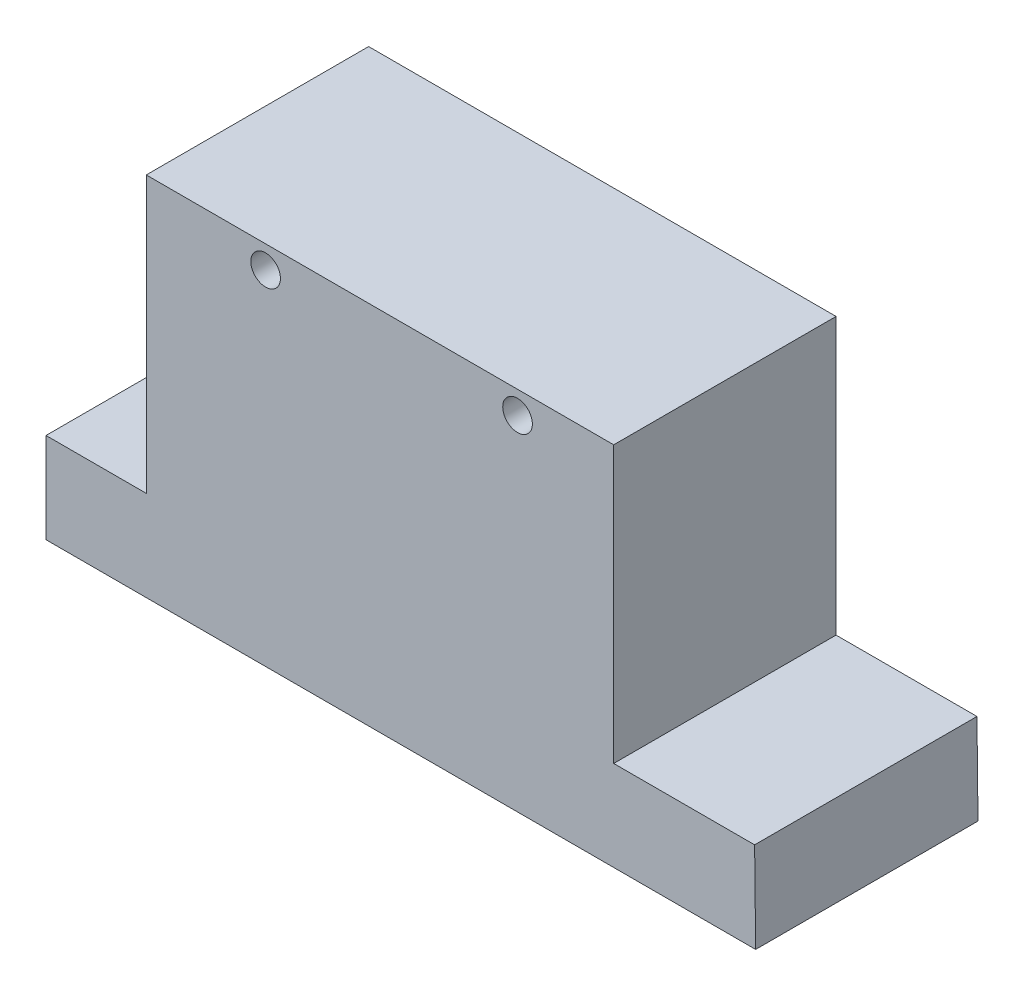
ISO-10303-21;
HEADER;
FILE_DESCRIPTION(('STEP AP214'),'2;1');
FILE_NAME('part.step','',(''),(''),'','','');
FILE_SCHEMA(('AUTOMOTIVE_DESIGN { 1 0 10303 214 1 1 1 1 }'));
ENDSEC;
DATA;
#1=APPLICATION_CONTEXT('core data for automotive mechanical design processes');
#2=APPLICATION_PROTOCOL_DEFINITION('international standard','automotive_design',2000,#1);
#3=PRODUCT_CONTEXT('',#1,'mechanical');
#4=PRODUCT('Part','Part','',(#3));
#5=PRODUCT_RELATED_PRODUCT_CATEGORY('part','',(#4));
#6=PRODUCT_DEFINITION_FORMATION('','',#4);
#7=PRODUCT_DEFINITION_CONTEXT('part definition',#1,'design');
#8=PRODUCT_DEFINITION('design','',#6,#7);
#9=PRODUCT_DEFINITION_SHAPE('','',#8);
#10=(LENGTH_UNIT() NAMED_UNIT(*) SI_UNIT(.MILLI.,.METRE.));
#11=(NAMED_UNIT(*) PLANE_ANGLE_UNIT() SI_UNIT($,.RADIAN.));
#12=(NAMED_UNIT(*) SI_UNIT($,.STERADIAN.) SOLID_ANGLE_UNIT());
#13=UNCERTAINTY_MEASURE_WITH_UNIT(LENGTH_MEASURE(1.E-05),#10,'distance_accuracy_value','');
#14=(GEOMETRIC_REPRESENTATION_CONTEXT(3) GLOBAL_UNCERTAINTY_ASSIGNED_CONTEXT((#13)) GLOBAL_UNIT_ASSIGNED_CONTEXT((#10,
#11,#12)) REPRESENTATION_CONTEXT('',''));
#15=CARTESIAN_POINT('',(0.,0.,0.));
#16=DIRECTION('',(0.,0.,1.));
#17=DIRECTION('',(1.,0.,0.));
#18=AXIS2_PLACEMENT_3D('',#15,#16,#17);
#19=CARTESIAN_POINT('',(0.,0.,60.));
#20=DIRECTION('',(0.,0.,1.));
#21=DIRECTION('',(1.,0.,0.));
#22=AXIS2_PLACEMENT_3D('',#19,#20,#21);
#23=PLANE('',#22);
#24=CARTESIAN_POINT('',(-46.2713659081402,61.5865207292527,60.));
#25=DIRECTION('',(0.,0.,1.));
#26=DIRECTION('',(1.,0.,0.));
#27=AXIS2_PLACEMENT_3D('',#24,#25,#26);
#28=CIRCLE('',#27,4.00000000000001);
#29=CARTESIAN_POINT('',(-42.2713659081402,61.5865207292527,60.));
#30=VERTEX_POINT('',#29);
#31=EDGE_CURVE('E135',#30,#30,#28,.T.);
#32=ORIENTED_EDGE('',*,*,#31,.F.);
#33=EDGE_LOOP('',(#32));
#34=FACE_BOUND('',#33,.T.);
#35=DIRECTION('',(1.,0.,0.));
#36=VECTOR('',#35,1.);
#37=CARTESIAN_POINT('',(-55.837306641314,-31.0846861714532,60.));
#38=LINE('',#37,#36);
#39=CARTESIAN_POINT('',(-105.534428359872,-31.0846861714532,60.));
#40=VERTEX_POINT('',#39);
#41=CARTESIAN_POINT('',(85.9646266435408,-31.0846861714532,60.));
#42=VERTEX_POINT('',#41);
#43=EDGE_CURVE('E52',#40,#42,#38,.T.);
#44=ORIENTED_EDGE('',*,*,#43,.T.);
#45=DIRECTION('',(-0.0114992295133664,0.999933881674483,0.));
#46=VECTOR('',#45,1.);
#47=CARTESIAN_POINT('',(85.6850373949808,-6.77255619247591,60.));
#48=LINE('',#47,#46);
#49=CARTESIAN_POINT('',(85.6850373949808,-6.77255619247591,60.));
#50=VERTEX_POINT('',#49);
#51=EDGE_CURVE('E181',#42,#50,#48,.T.);
#52=ORIENTED_EDGE('',*,*,#51,.T.);
#53=DIRECTION('',(-1.,0.,0.));
#54=VECTOR('',#53,1.);
#55=CARTESIAN_POINT('',(47.6605646258548,-6.77255619247591,60.));
#56=LINE('',#55,#54);
#57=CARTESIAN_POINT('',(47.6605646258548,-6.77255619247591,60.));
#58=VERTEX_POINT('',#57);
#59=EDGE_CURVE('E161',#50,#58,#56,.T.);
#60=ORIENTED_EDGE('',*,*,#59,.T.);
#61=DIRECTION('',(0.,1.,0.));
#62=VECTOR('',#61,1.);
#63=CARTESIAN_POINT('',(47.6605646258548,-6.77255619247591,60.));
#64=LINE('',#63,#62);
#65=CARTESIAN_POINT('',(47.6605646258545,67.7011176079763,60.));
#66=VERTEX_POINT('',#65);
#67=EDGE_CURVE('E177',#58,#66,#64,.T.);
#68=ORIENTED_EDGE('',*,*,#67,.T.);
#69=DIRECTION('',(-1.,0.,0.));
#70=VECTOR('',#69,1.);
#71=CARTESIAN_POINT('',(-78.4773436223531,67.7011176079763,60.));
#72=LINE('',#71,#70);
#73=CARTESIAN_POINT('',(-78.4773436223531,67.7011176079763,60.));
#74=VERTEX_POINT('',#73);
#75=EDGE_CURVE('E112',#66,#74,#72,.T.);
#76=ORIENTED_EDGE('',*,*,#75,.T.);
#77=DIRECTION('',(0.,-1.,0.));
#78=VECTOR('',#77,1.);
#79=CARTESIAN_POINT('',(-78.4773436223531,-6.71582725926458,60.));
#80=LINE('',#79,#78);
#81=CARTESIAN_POINT('',(-78.4773436223531,-6.71582725926458,60.));
#82=VERTEX_POINT('',#81);
#83=EDGE_CURVE('E106',#74,#82,#80,.T.);
#84=ORIENTED_EDGE('',*,*,#83,.T.);
#85=DIRECTION('',(-1.,0.,0.));
#86=VECTOR('',#85,1.);
#87=CARTESIAN_POINT('',(-78.4773436223531,-6.71582725926458,60.));
#88=LINE('',#87,#86);
#89=CARTESIAN_POINT('',(-105.534428359872,-6.71582725926458,60.));
#90=VERTEX_POINT('',#89);
#91=EDGE_CURVE('E110',#82,#90,#88,.T.);
#92=ORIENTED_EDGE('',*,*,#91,.T.);
#93=DIRECTION('',(0.,-1.,0.));
#94=VECTOR('',#93,1.);
#95=CARTESIAN_POINT('',(-105.534428359872,-6.71582725926458,60.));
#96=LINE('',#95,#94);
#97=EDGE_CURVE('E126',#90,#40,#96,.T.);
#98=ORIENTED_EDGE('',*,*,#97,.T.);
#99=EDGE_LOOP('',(#44,#52,#60,#68,#76,#84,#92,#98));
#100=FACE_BOUND('',#99,.T.);
#101=CARTESIAN_POINT('',(21.7106262171154,61.5865207292527,60.));
#102=DIRECTION('',(0.,0.,1.));
#103=DIRECTION('',(-1.,0.,0.));
#104=AXIS2_PLACEMENT_3D('',#101,#102,#103);
#105=CIRCLE('',#104,4.00000000000001);
#106=CARTESIAN_POINT('',(17.7106262171154,61.5865207292527,60.));
#107=VERTEX_POINT('',#106);
#108=EDGE_CURVE('E187',#107,#107,#105,.T.);
#109=ORIENTED_EDGE('',*,*,#108,.F.);
#110=EDGE_LOOP('',(#109));
#111=FACE_BOUND('',#110,.T.);
#112=ADVANCED_FACE('F35',(#34,#100,#111),#23,.T.);
#113=CARTESIAN_POINT('',(0.,0.,0.));
#114=DIRECTION('',(0.,0.,1.));
#115=DIRECTION('',(1.,0.,0.));
#116=AXIS2_PLACEMENT_3D('',#113,#114,#115);
#117=PLANE('',#116);
#118=DIRECTION('',(-0.0114992295133664,0.999933881674483,0.));
#119=VECTOR('',#118,1.);
#120=CARTESIAN_POINT('',(85.6850373949808,-6.77255619247591,0.));
#121=LINE('',#120,#119);
#122=CARTESIAN_POINT('',(85.9646266435408,-31.0846861714532,0.));
#123=VERTEX_POINT('',#122);
#124=CARTESIAN_POINT('',(85.6850373949808,-6.77255619247591,0.));
#125=VERTEX_POINT('',#124);
#126=EDGE_CURVE('E132',#123,#125,#121,.T.);
#127=ORIENTED_EDGE('',*,*,#126,.F.);
#128=DIRECTION('',(1.,0.,0.));
#129=VECTOR('',#128,1.);
#130=CARTESIAN_POINT('',(-55.837306641314,-31.0846861714532,0.));
#131=LINE('',#130,#129);
#132=CARTESIAN_POINT('',(-105.534428359872,-31.0846861714532,0.));
#133=VERTEX_POINT('',#132);
#134=EDGE_CURVE('E144',#133,#123,#131,.T.);
#135=ORIENTED_EDGE('',*,*,#134,.F.);
#136=DIRECTION('',(0.,-1.,0.));
#137=VECTOR('',#136,1.);
#138=CARTESIAN_POINT('',(-105.534428359872,-6.71582725926458,0.));
#139=LINE('',#138,#137);
#140=CARTESIAN_POINT('',(-105.534428359872,-6.71582725926458,0.));
#141=VERTEX_POINT('',#140);
#142=EDGE_CURVE('E89',#141,#133,#139,.T.);
#143=ORIENTED_EDGE('',*,*,#142,.F.);
#144=DIRECTION('',(-1.,0.,0.));
#145=VECTOR('',#144,1.);
#146=CARTESIAN_POINT('',(-78.4773436223531,-6.71582725926458,0.));
#147=LINE('',#146,#145);
#148=CARTESIAN_POINT('',(-78.4773436223531,-6.71582725926458,0.));
#149=VERTEX_POINT('',#148);
#150=EDGE_CURVE('E82',#149,#141,#147,.T.);
#151=ORIENTED_EDGE('',*,*,#150,.F.);
#152=DIRECTION('',(0.,-1.,0.));
#153=VECTOR('',#152,1.);
#154=CARTESIAN_POINT('',(-78.4773436223531,-6.71582725926458,0.));
#155=LINE('',#154,#153);
#156=CARTESIAN_POINT('',(-78.4773436223531,67.7011176079763,0.));
#157=VERTEX_POINT('',#156);
#158=EDGE_CURVE('E120',#157,#149,#155,.T.);
#159=ORIENTED_EDGE('',*,*,#158,.F.);
#160=DIRECTION('',(-1.,0.,0.));
#161=VECTOR('',#160,1.);
#162=CARTESIAN_POINT('',(-78.4773436223531,67.7011176079763,0.));
#163=LINE('',#162,#161);
#164=CARTESIAN_POINT('',(47.6605646258545,67.7011176079763,0.));
#165=VERTEX_POINT('',#164);
#166=EDGE_CURVE('E139',#165,#157,#163,.T.);
#167=ORIENTED_EDGE('',*,*,#166,.F.);
#168=DIRECTION('',(0.,1.,0.));
#169=VECTOR('',#168,1.);
#170=CARTESIAN_POINT('',(47.6605646258548,-6.77255619247591,0.));
#171=LINE('',#170,#169);
#172=CARTESIAN_POINT('',(47.6605646258548,-6.77255619247591,0.));
#173=VERTEX_POINT('',#172);
#174=EDGE_CURVE('E137',#173,#165,#171,.T.);
#175=ORIENTED_EDGE('',*,*,#174,.F.);
#176=DIRECTION('',(-1.,0.,0.));
#177=VECTOR('',#176,1.);
#178=CARTESIAN_POINT('',(47.6605646258548,-6.77255619247591,0.));
#179=LINE('',#178,#177);
#180=EDGE_CURVE('E134',#125,#173,#179,.T.);
#181=ORIENTED_EDGE('',*,*,#180,.F.);
#182=EDGE_LOOP('',(#127,#135,#143,#151,#159,#167,#175,#181));
#183=FACE_BOUND('',#182,.T.);
#184=CARTESIAN_POINT('',(-46.2713659081402,61.5865207292527,0.));
#185=DIRECTION('',(0.,0.,1.));
#186=DIRECTION('',(1.,0.,0.));
#187=AXIS2_PLACEMENT_3D('',#184,#185,#186);
#188=CIRCLE('',#187,4.00000000000001);
#189=CARTESIAN_POINT('',(-42.2713659081402,61.5865207292527,0.));
#190=VERTEX_POINT('',#189);
#191=EDGE_CURVE('E184',#190,#190,#188,.T.);
#192=ORIENTED_EDGE('',*,*,#191,.T.);
#193=EDGE_LOOP('',(#192));
#194=FACE_BOUND('',#193,.T.);
#195=CARTESIAN_POINT('',(21.7106262171154,61.5865207292527,0.));
#196=DIRECTION('',(0.,0.,1.));
#197=DIRECTION('',(-1.,0.,0.));
#198=AXIS2_PLACEMENT_3D('',#195,#196,#197);
#199=CIRCLE('',#198,4.00000000000001);
#200=CARTESIAN_POINT('',(17.7106262171154,61.5865207292527,0.));
#201=VERTEX_POINT('',#200);
#202=EDGE_CURVE('E190',#201,#201,#199,.T.);
#203=ORIENTED_EDGE('',*,*,#202,.T.);
#204=EDGE_LOOP('',(#203));
#205=FACE_BOUND('',#204,.T.);
#206=ADVANCED_FACE('F167',(#183,#194,#205),#117,.F.);
#207=CARTESIAN_POINT('',(85.6850373949808,-6.77255619247591,60.));
#208=DIRECTION('',(-0.999933881674483,-0.0114992295133664,0.));
#209=DIRECTION('',(0.0114992295133664,-0.999933881674483,0.));
#210=AXIS2_PLACEMENT_3D('',#207,#208,#209);
#211=PLANE('',#210);
#212=ORIENTED_EDGE('',*,*,#126,.T.);
#213=DIRECTION('',(0.,0.,-1.));
#214=VECTOR('',#213,1.);
#215=CARTESIAN_POINT('',(85.6850373949808,-6.77255619247591,60.));
#216=LINE('',#215,#214);
#217=EDGE_CURVE('E44',#50,#125,#216,.T.);
#218=ORIENTED_EDGE('',*,*,#217,.F.);
#219=ORIENTED_EDGE('',*,*,#51,.F.);
#220=DIRECTION('',(0.,0.,-1.));
#221=VECTOR('',#220,1.);
#222=CARTESIAN_POINT('',(85.9646266435408,-31.0846861714532,60.));
#223=LINE('',#222,#221);
#224=EDGE_CURVE('E11',#42,#123,#223,.T.);
#225=ORIENTED_EDGE('',*,*,#224,.T.);
#226=EDGE_LOOP('',(#212,#218,#219,#225));
#227=FACE_BOUND('',#226,.T.);
#228=ADVANCED_FACE('F37',(#227),#211,.F.);
#229=CARTESIAN_POINT('',(47.6605646258548,-6.77255619247591,60.));
#230=DIRECTION('',(0.,-1.,0.));
#231=DIRECTION('',(0.,0.,-1.));
#232=AXIS2_PLACEMENT_3D('',#229,#230,#231);
#233=PLANE('',#232);
#234=ORIENTED_EDGE('',*,*,#180,.T.);
#235=DIRECTION('',(0.,0.,-1.));
#236=VECTOR('',#235,1.);
#237=CARTESIAN_POINT('',(47.6605646258548,-6.77255619247591,60.));
#238=LINE('',#237,#236);
#239=EDGE_CURVE('E152',#58,#173,#238,.T.);
#240=ORIENTED_EDGE('',*,*,#239,.F.);
#241=ORIENTED_EDGE('',*,*,#59,.F.);
#242=ORIENTED_EDGE('',*,*,#217,.T.);
#243=EDGE_LOOP('',(#234,#240,#241,#242));
#244=FACE_BOUND('',#243,.T.);
#245=ADVANCED_FACE('F159',(#244),#233,.F.);
#246=CARTESIAN_POINT('',(47.6605646258548,-6.77255619247591,60.));
#247=DIRECTION('',(-1.,0.,0.));
#248=DIRECTION('',(0.,-1.,0.));
#249=AXIS2_PLACEMENT_3D('',#246,#247,#248);
#250=PLANE('',#249);
#251=ORIENTED_EDGE('',*,*,#174,.T.);
#252=DIRECTION('',(0.,0.,-1.));
#253=VECTOR('',#252,1.);
#254=CARTESIAN_POINT('',(47.6605646258545,67.7011176079763,60.));
#255=LINE('',#254,#253);
#256=EDGE_CURVE('E149',#66,#165,#255,.T.);
#257=ORIENTED_EDGE('',*,*,#256,.F.);
#258=ORIENTED_EDGE('',*,*,#67,.F.);
#259=ORIENTED_EDGE('',*,*,#239,.T.);
#260=EDGE_LOOP('',(#251,#257,#258,#259));
#261=FACE_BOUND('',#260,.T.);
#262=ADVANCED_FACE('F173',(#261),#250,.F.);
#263=CARTESIAN_POINT('',(-78.4773436223531,67.7011176079763,60.));
#264=DIRECTION('',(0.,-1.,0.));
#265=DIRECTION('',(0.,0.,-1.));
#266=AXIS2_PLACEMENT_3D('',#263,#264,#265);
#267=PLANE('',#266);
#268=ORIENTED_EDGE('',*,*,#166,.T.);
#269=DIRECTION('',(0.,0.,-1.));
#270=VECTOR('',#269,1.);
#271=CARTESIAN_POINT('',(-78.4773436223531,67.7011176079763,60.));
#272=LINE('',#271,#270);
#273=EDGE_CURVE('E121',#74,#157,#272,.T.);
#274=ORIENTED_EDGE('',*,*,#273,.F.);
#275=ORIENTED_EDGE('',*,*,#75,.F.);
#276=ORIENTED_EDGE('',*,*,#256,.T.);
#277=EDGE_LOOP('',(#268,#274,#275,#276));
#278=FACE_BOUND('',#277,.T.);
#279=ADVANCED_FACE('F176',(#278),#267,.F.);
#280=CARTESIAN_POINT('',(-78.4773436223531,-6.71582725926458,60.));
#281=DIRECTION('',(1.,0.,0.));
#282=DIRECTION('',(0.,0.,-1.));
#283=AXIS2_PLACEMENT_3D('',#280,#281,#282);
#284=PLANE('',#283);
#285=ORIENTED_EDGE('',*,*,#158,.T.);
#286=DIRECTION('',(0.,0.,-1.));
#287=VECTOR('',#286,1.);
#288=CARTESIAN_POINT('',(-78.4773436223531,-6.71582725926458,60.));
#289=LINE('',#288,#287);
#290=EDGE_CURVE('E117',#82,#149,#289,.T.);
#291=ORIENTED_EDGE('',*,*,#290,.F.);
#292=ORIENTED_EDGE('',*,*,#83,.F.);
#293=ORIENTED_EDGE('',*,*,#273,.T.);
#294=EDGE_LOOP('',(#285,#291,#292,#293));
#295=FACE_BOUND('',#294,.T.);
#296=ADVANCED_FACE('F118',(#295),#284,.F.);
#297=CARTESIAN_POINT('',(-78.4773436223531,-6.71582725926458,60.));
#298=DIRECTION('',(0.,-1.,0.));
#299=DIRECTION('',(0.,0.,-1.));
#300=AXIS2_PLACEMENT_3D('',#297,#298,#299);
#301=PLANE('',#300);
#302=ORIENTED_EDGE('',*,*,#150,.T.);
#303=DIRECTION('',(0.,0.,-1.));
#304=VECTOR('',#303,1.);
#305=CARTESIAN_POINT('',(-105.534428359872,-6.71582725926458,60.));
#306=LINE('',#305,#304);
#307=EDGE_CURVE('E122',#90,#141,#306,.T.);
#308=ORIENTED_EDGE('',*,*,#307,.F.);
#309=ORIENTED_EDGE('',*,*,#91,.F.);
#310=ORIENTED_EDGE('',*,*,#290,.T.);
#311=EDGE_LOOP('',(#302,#308,#309,#310));
#312=FACE_BOUND('',#311,.T.);
#313=ADVANCED_FACE('F124',(#312),#301,.F.);
#314=CARTESIAN_POINT('',(-105.534428359872,-6.71582725926458,60.));
#315=DIRECTION('',(1.,0.,0.));
#316=DIRECTION('',(0.,0.,-1.));
#317=AXIS2_PLACEMENT_3D('',#314,#315,#316);
#318=PLANE('',#317);
#319=ORIENTED_EDGE('',*,*,#142,.T.);
#320=DIRECTION('',(0.,0.,-1.));
#321=VECTOR('',#320,1.);
#322=CARTESIAN_POINT('',(-105.534428359872,-31.0846861714532,60.));
#323=LINE('',#322,#321);
#324=EDGE_CURVE('E128',#40,#133,#323,.T.);
#325=ORIENTED_EDGE('',*,*,#324,.F.);
#326=ORIENTED_EDGE('',*,*,#97,.F.);
#327=ORIENTED_EDGE('',*,*,#307,.T.);
#328=EDGE_LOOP('',(#319,#325,#326,#327));
#329=FACE_BOUND('',#328,.T.);
#330=ADVANCED_FACE('F213',(#329),#318,.F.);
#331=CARTESIAN_POINT('',(-55.837306641314,-31.0846861714532,60.));
#332=DIRECTION('',(0.,1.,0.));
#333=DIRECTION('',(0.,0.,1.));
#334=AXIS2_PLACEMENT_3D('',#331,#332,#333);
#335=PLANE('',#334);
#336=ORIENTED_EDGE('',*,*,#134,.T.);
#337=ORIENTED_EDGE('',*,*,#224,.F.);
#338=ORIENTED_EDGE('',*,*,#43,.F.);
#339=ORIENTED_EDGE('',*,*,#324,.T.);
#340=EDGE_LOOP('',(#336,#337,#338,#339));
#341=FACE_BOUND('',#340,.T.);
#342=ADVANCED_FACE('F210',(#341),#335,.F.);
#343=CARTESIAN_POINT('',(-46.2713659081402,61.5865207292527,60.));
#344=DIRECTION('',(0.,0.,-1.));
#345=DIRECTION('',(-1.,0.,0.));
#346=AXIS2_PLACEMENT_3D('',#343,#344,#345);
#347=CYLINDRICAL_SURFACE('',#346,4.00000000000001);
#348=ORIENTED_EDGE('',*,*,#31,.T.);
#349=EDGE_LOOP('',(#348));
#350=FACE_BOUND('',#349,.T.);
#351=ORIENTED_EDGE('',*,*,#191,.F.);
#352=EDGE_LOOP('',(#351));
#353=FACE_BOUND('',#352,.T.);
#354=ADVANCED_FACE('F207',(#350,#353),#347,.F.);
#355=CARTESIAN_POINT('',(21.7106262171154,61.5865207292527,60.));
#356=DIRECTION('',(0.,0.,-1.));
#357=DIRECTION('',(-1.,0.,0.));
#358=AXIS2_PLACEMENT_3D('',#355,#356,#357);
#359=CYLINDRICAL_SURFACE('',#358,4.00000000000001);
#360=ORIENTED_EDGE('',*,*,#108,.T.);
#361=EDGE_LOOP('',(#360));
#362=FACE_BOUND('',#361,.T.);
#363=ORIENTED_EDGE('',*,*,#202,.F.);
#364=EDGE_LOOP('',(#363));
#365=FACE_BOUND('',#364,.T.);
#366=ADVANCED_FACE('F196',(#362,#365),#359,.F.);
#367=CLOSED_SHELL('',(#112,#206,#228,#245,#262,#279,#296,#313,#330,#342,#354,#366));
#368=MANIFOLD_SOLID_BREP('B2',#367);
#369=ADVANCED_BREP_SHAPE_REPRESENTATION('',(#18,#368),#14);
#370=SHAPE_DEFINITION_REPRESENTATION(#9,#369);
ENDSEC;
END-ISO-10303-21;
